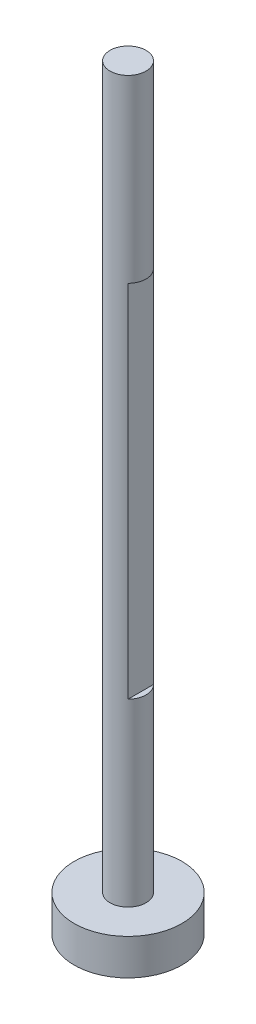
ISO-10303-21;
HEADER;
FILE_DESCRIPTION(('STEP AP214'),'2;1');
FILE_NAME('part.step','',(''),(''),'','','');
FILE_SCHEMA(('AUTOMOTIVE_DESIGN { 1 0 10303 214 1 1 1 1 }'));
ENDSEC;
DATA;
#1=APPLICATION_CONTEXT('core data for automotive mechanical design processes');
#2=APPLICATION_PROTOCOL_DEFINITION('international standard','automotive_design',2000,#1);
#3=PRODUCT_CONTEXT('',#1,'mechanical');
#4=PRODUCT('Part','Part','',(#3));
#5=PRODUCT_RELATED_PRODUCT_CATEGORY('part','',(#4));
#6=PRODUCT_DEFINITION_FORMATION('','',#4);
#7=PRODUCT_DEFINITION_CONTEXT('part definition',#1,'design');
#8=PRODUCT_DEFINITION('design','',#6,#7);
#9=PRODUCT_DEFINITION_SHAPE('','',#8);
#10=(LENGTH_UNIT() NAMED_UNIT(*) SI_UNIT(.MILLI.,.METRE.));
#11=(NAMED_UNIT(*) PLANE_ANGLE_UNIT() SI_UNIT($,.RADIAN.));
#12=(NAMED_UNIT(*) SI_UNIT($,.STERADIAN.) SOLID_ANGLE_UNIT());
#13=UNCERTAINTY_MEASURE_WITH_UNIT(LENGTH_MEASURE(1.E-05),#10,'distance_accuracy_value','');
#14=(GEOMETRIC_REPRESENTATION_CONTEXT(3) GLOBAL_UNCERTAINTY_ASSIGNED_CONTEXT((#13)) GLOBAL_UNIT_ASSIGNED_CONTEXT((#10,
#11,#12)) REPRESENTATION_CONTEXT('',''));
#15=CARTESIAN_POINT('',(0.,0.,0.));
#16=DIRECTION('',(0.,0.,1.));
#17=DIRECTION('',(1.,0.,0.));
#18=AXIS2_PLACEMENT_3D('',#15,#16,#17);
#19=CARTESIAN_POINT('',(0.,127.,0.));
#20=DIRECTION('',(0.,-1.,0.));
#21=DIRECTION('',(0.,0.,-1.));
#22=AXIS2_PLACEMENT_3D('',#19,#20,#21);
#23=CYLINDRICAL_SURFACE('',#22,3.175);
#24=DIRECTION('',(0.,-1.,0.));
#25=VECTOR('',#24,1.);
#26=CARTESIAN_POINT('',(2.24506403026728,95.25,2.24506403026729));
#27=LINE('',#26,#25);
#28=CARTESIAN_POINT('',(2.24506403026728,95.25,2.24506403026729));
#29=VERTEX_POINT('',#28);
#30=CARTESIAN_POINT('',(2.24506403026728,31.75,2.24506403026729));
#31=VERTEX_POINT('',#30);
#32=EDGE_CURVE('E73',#29,#31,#27,.T.);
#33=ORIENTED_EDGE('',*,*,#32,.F.);
#34=CARTESIAN_POINT('',(0.,95.25,0.));
#35=DIRECTION('',(0.,1.,0.));
#36=DIRECTION('',(0.,0.,1.));
#37=AXIS2_PLACEMENT_3D('',#34,#35,#36);
#38=CIRCLE('',#37,3.175);
#39=CARTESIAN_POINT('',(2.24506403026729,95.25,-2.24506403026728));
#40=VERTEX_POINT('',#39);
#41=EDGE_CURVE('E11',#29,#40,#38,.T.);
#42=ORIENTED_EDGE('',*,*,#41,.T.);
#43=DIRECTION('',(0.,-1.,0.));
#44=VECTOR('',#43,1.);
#45=CARTESIAN_POINT('',(2.24506403026729,95.25,-2.24506403026728));
#46=LINE('',#45,#44);
#47=CARTESIAN_POINT('',(2.24506403026729,31.75,-2.24506403026728));
#48=VERTEX_POINT('',#47);
#49=EDGE_CURVE('E61',#40,#48,#46,.T.);
#50=ORIENTED_EDGE('',*,*,#49,.T.);
#51=CARTESIAN_POINT('',(0.,31.75,0.));
#52=DIRECTION('',(0.,1.,0.));
#53=DIRECTION('',(0.,0.,1.));
#54=AXIS2_PLACEMENT_3D('',#51,#52,#53);
#55=CIRCLE('',#54,3.175);
#56=EDGE_CURVE('E47',#31,#48,#55,.T.);
#57=ORIENTED_EDGE('',*,*,#56,.F.);
#58=EDGE_LOOP('',(#33,#42,#50,#57));
#59=FACE_BOUND('',#58,.T.);
#60=CARTESIAN_POINT('',(0.,127.,0.));
#61=DIRECTION('',(0.,1.,0.));
#62=DIRECTION('',(0.,0.,1.));
#63=AXIS2_PLACEMENT_3D('',#60,#61,#62);
#64=CIRCLE('',#63,3.175);
#65=CARTESIAN_POINT('',(0.,127.,3.175));
#66=VERTEX_POINT('',#65);
#67=EDGE_CURVE('E71',#66,#66,#64,.T.);
#68=ORIENTED_EDGE('',*,*,#67,.F.);
#69=EDGE_LOOP('',(#68));
#70=FACE_BOUND('',#69,.T.);
#71=CARTESIAN_POINT('',(0.,0.,0.));
#72=DIRECTION('',(0.,1.,0.));
#73=DIRECTION('',(0.,0.,1.));
#74=AXIS2_PLACEMENT_3D('',#71,#72,#73);
#75=CIRCLE('',#74,3.175);
#76=CARTESIAN_POINT('',(0.,0.,3.175));
#77=VERTEX_POINT('',#76);
#78=EDGE_CURVE('E76',#77,#77,#75,.T.);
#79=ORIENTED_EDGE('',*,*,#78,.T.);
#80=EDGE_LOOP('',(#79));
#81=FACE_BOUND('',#80,.T.);
#82=ADVANCED_FACE('F39',(#59,#70,#81),#23,.T.);
#83=CARTESIAN_POINT('',(0.,127.,0.));
#84=DIRECTION('',(0.,1.,0.));
#85=DIRECTION('',(0.,0.,1.));
#86=AXIS2_PLACEMENT_3D('',#83,#84,#85);
#87=PLANE('',#86);
#88=ORIENTED_EDGE('',*,*,#67,.T.);
#89=EDGE_LOOP('',(#88));
#90=FACE_BOUND('',#89,.T.);
#91=ADVANCED_FACE('F106',(#90),#87,.T.);
#92=CARTESIAN_POINT('',(0.,95.25,0.));
#93=DIRECTION('',(0.,1.,0.));
#94=DIRECTION('',(0.,0.,1.));
#95=AXIS2_PLACEMENT_3D('',#92,#93,#94);
#96=PLANE('',#95);
#97=DIRECTION('',(0.,0.,-1.));
#98=VECTOR('',#97,1.);
#99=CARTESIAN_POINT('',(2.24506403026728,95.25,2.24506403026729));
#100=LINE('',#99,#98);
#101=EDGE_CURVE('E75',#29,#40,#100,.T.);
#102=ORIENTED_EDGE('',*,*,#101,.T.);
#103=ORIENTED_EDGE('',*,*,#41,.F.);
#104=EDGE_LOOP('',(#102,#103));
#105=FACE_BOUND('',#104,.T.);
#106=ADVANCED_FACE('F104',(#105),#96,.F.);
#107=CARTESIAN_POINT('',(0.,31.75,0.));
#108=DIRECTION('',(0.,1.,0.));
#109=DIRECTION('',(0.,0.,1.));
#110=AXIS2_PLACEMENT_3D('',#107,#108,#109);
#111=PLANE('',#110);
#112=ORIENTED_EDGE('',*,*,#56,.T.);
#113=DIRECTION('',(0.,0.,-1.));
#114=VECTOR('',#113,1.);
#115=CARTESIAN_POINT('',(2.24506403026728,31.75,2.24506403026729));
#116=LINE('',#115,#114);
#117=EDGE_CURVE('E53',#31,#48,#116,.T.);
#118=ORIENTED_EDGE('',*,*,#117,.F.);
#119=EDGE_LOOP('',(#112,#118));
#120=FACE_BOUND('',#119,.T.);
#121=ADVANCED_FACE('F67',(#120),#111,.T.);
#122=CARTESIAN_POINT('',(2.24506403026728,95.25,2.24506403026729));
#123=DIRECTION('',(-1.,0.,0.));
#124=DIRECTION('',(0.,0.,1.));
#125=AXIS2_PLACEMENT_3D('',#122,#123,#124);
#126=PLANE('',#125);
#127=ORIENTED_EDGE('',*,*,#117,.T.);
#128=ORIENTED_EDGE('',*,*,#49,.F.);
#129=ORIENTED_EDGE('',*,*,#101,.F.);
#130=ORIENTED_EDGE('',*,*,#32,.T.);
#131=EDGE_LOOP('',(#127,#128,#129,#130));
#132=FACE_BOUND('',#131,.T.);
#133=ADVANCED_FACE('F72',(#132),#126,.F.);
#134=CARTESIAN_POINT('',(0.,-6.35,0.));
#135=DIRECTION('',(0.,1.,0.));
#136=DIRECTION('',(0.,0.,1.));
#137=AXIS2_PLACEMENT_3D('',#134,#135,#136);
#138=CYLINDRICAL_SURFACE('',#137,9.5);
#139=CARTESIAN_POINT('',(0.,-6.35,0.));
#140=DIRECTION('',(0.,-1.,0.));
#141=DIRECTION('',(0.,0.,-1.));
#142=AXIS2_PLACEMENT_3D('',#139,#140,#141);
#143=CIRCLE('',#142,9.5);
#144=CARTESIAN_POINT('',(0.,-6.35,-9.5));
#145=VERTEX_POINT('',#144);
#146=EDGE_CURVE('E90',#145,#145,#143,.T.);
#147=ORIENTED_EDGE('',*,*,#146,.F.);
#148=EDGE_LOOP('',(#147));
#149=FACE_BOUND('',#148,.T.);
#150=CARTESIAN_POINT('',(0.,0.,0.));
#151=DIRECTION('',(0.,-1.,0.));
#152=DIRECTION('',(0.,0.,-1.));
#153=AXIS2_PLACEMENT_3D('',#150,#151,#152);
#154=CIRCLE('',#153,9.5);
#155=CARTESIAN_POINT('',(0.,0.,-9.5));
#156=VERTEX_POINT('',#155);
#157=EDGE_CURVE('E95',#156,#156,#154,.T.);
#158=ORIENTED_EDGE('',*,*,#157,.T.);
#159=EDGE_LOOP('',(#158));
#160=FACE_BOUND('',#159,.T.);
#161=ADVANCED_FACE('F143',(#149,#160),#138,.T.);
#162=CARTESIAN_POINT('',(0.,-6.35,0.));
#163=DIRECTION('',(0.,-1.,0.));
#164=DIRECTION('',(0.,0.,-1.));
#165=AXIS2_PLACEMENT_3D('',#162,#163,#164);
#166=PLANE('',#165);
#167=ORIENTED_EDGE('',*,*,#146,.T.);
#168=EDGE_LOOP('',(#167));
#169=FACE_BOUND('',#168,.T.);
#170=ADVANCED_FACE('F151',(#169),#166,.T.);
#171=CARTESIAN_POINT('',(0.,0.,0.));
#172=DIRECTION('',(0.,-1.,0.));
#173=DIRECTION('',(0.,0.,-1.));
#174=AXIS2_PLACEMENT_3D('',#171,#172,#173);
#175=PLANE('',#174);
#176=ORIENTED_EDGE('',*,*,#78,.F.);
#177=EDGE_LOOP('',(#176));
#178=FACE_BOUND('',#177,.T.);
#179=ORIENTED_EDGE('',*,*,#157,.F.);
#180=EDGE_LOOP('',(#179));
#181=FACE_BOUND('',#180,.T.);
#182=ADVANCED_FACE('F159',(#178,#181),#175,.F.);
#183=CLOSED_SHELL('',(#82,#91,#106,#121,#133,#161,#170,#182));
#184=MANIFOLD_SOLID_BREP('B2',#183);
#185=ADVANCED_BREP_SHAPE_REPRESENTATION('',(#18,#184),#14);
#186=SHAPE_DEFINITION_REPRESENTATION(#9,#185);
ENDSEC;
END-ISO-10303-21;
